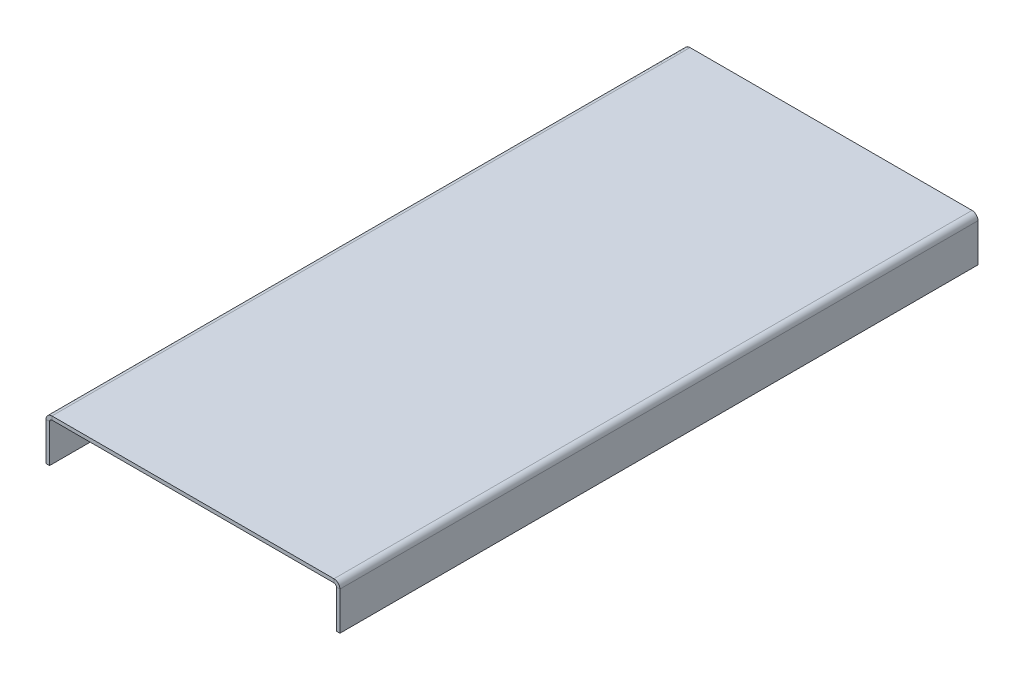
ISO-10303-21;
HEADER;
FILE_DESCRIPTION(('STEP AP214'),'2;1');
FILE_NAME('part.step','',(''),(''),'','','');
FILE_SCHEMA(('AUTOMOTIVE_DESIGN { 1 0 10303 214 1 1 1 1 }'));
ENDSEC;
DATA;
#1=APPLICATION_CONTEXT('core data for automotive mechanical design processes');
#2=APPLICATION_PROTOCOL_DEFINITION('international standard','automotive_design',2000,#1);
#3=PRODUCT_CONTEXT('',#1,'mechanical');
#4=PRODUCT('Part','Part','',(#3));
#5=PRODUCT_RELATED_PRODUCT_CATEGORY('part','',(#4));
#6=PRODUCT_DEFINITION_FORMATION('','',#4);
#7=PRODUCT_DEFINITION_CONTEXT('part definition',#1,'design');
#8=PRODUCT_DEFINITION('design','',#6,#7);
#9=PRODUCT_DEFINITION_SHAPE('','',#8);
#10=(LENGTH_UNIT() NAMED_UNIT(*) SI_UNIT(.MILLI.,.METRE.));
#11=(NAMED_UNIT(*) PLANE_ANGLE_UNIT() SI_UNIT($,.RADIAN.));
#12=(NAMED_UNIT(*) SI_UNIT($,.STERADIAN.) SOLID_ANGLE_UNIT());
#13=UNCERTAINTY_MEASURE_WITH_UNIT(LENGTH_MEASURE(1.E-05),#10,'distance_accuracy_value','');
#14=(GEOMETRIC_REPRESENTATION_CONTEXT(3) GLOBAL_UNCERTAINTY_ASSIGNED_CONTEXT((#13)) GLOBAL_UNIT_ASSIGNED_CONTEXT((#10,
#11,#12)) REPRESENTATION_CONTEXT('',''));
#15=CARTESIAN_POINT('',(0.,0.,0.));
#16=DIRECTION('',(0.,0.,1.));
#17=DIRECTION('',(1.,0.,0.));
#18=AXIS2_PLACEMENT_3D('',#15,#16,#17);
#19=CARTESIAN_POINT('',(120.,118.,0.));
#20=DIRECTION('',(0.,0.,-1.));
#21=DIRECTION('',(-1.,0.,0.));
#22=AXIS2_PLACEMENT_3D('',#19,#20,#21);
#23=PLANE('',#22);
#24=DIRECTION('',(1.,0.,0.));
#25=VECTOR('',#24,1.);
#26=CARTESIAN_POINT('',(120.,118.,0.));
#27=LINE('',#26,#25);
#28=CARTESIAN_POINT('',(120.,118.,0.));
#29=VERTEX_POINT('',#28);
#30=CARTESIAN_POINT('',(123.,118.,0.));
#31=VERTEX_POINT('',#30);
#32=EDGE_CURVE('E11',#29,#31,#27,.T.);
#33=ORIENTED_EDGE('',*,*,#32,.F.);
#34=CARTESIAN_POINT('',(118.,118.,0.));
#35=DIRECTION('',(0.,0.,-1.));
#36=DIRECTION('',(-1.,0.,0.));
#37=AXIS2_PLACEMENT_3D('',#34,#35,#36);
#38=CIRCLE('',#37,2.);
#39=CARTESIAN_POINT('',(118.,120.,0.));
#40=VERTEX_POINT('',#39);
#41=EDGE_CURVE('E192',#29,#40,#38,.F.);
#42=ORIENTED_EDGE('',*,*,#41,.T.);
#43=DIRECTION('',(0.,-1.,0.));
#44=VECTOR('',#43,1.);
#45=CARTESIAN_POINT('',(118.,123.,0.));
#46=LINE('',#45,#44);
#47=CARTESIAN_POINT('',(118.,123.,0.));
#48=VERTEX_POINT('',#47);
#49=EDGE_CURVE('E46',#48,#40,#46,.T.);
#50=ORIENTED_EDGE('',*,*,#49,.F.);
#51=CARTESIAN_POINT('',(118.,118.,0.));
#52=DIRECTION('',(0.,0.,1.));
#53=DIRECTION('',(1.,0.,0.));
#54=AXIS2_PLACEMENT_3D('',#51,#52,#53);
#55=CIRCLE('',#54,5.);
#56=EDGE_CURVE('E213',#31,#48,#55,.T.);
#57=ORIENTED_EDGE('',*,*,#56,.F.);
#58=EDGE_LOOP('',(#33,#42,#50,#57));
#59=FACE_BOUND('',#58,.T.);
#60=ADVANCED_FACE('F39',(#59),#23,.T.);
#61=CARTESIAN_POINT('',(118.,123.,0.));
#62=DIRECTION('',(0.,0.,-1.));
#63=DIRECTION('',(-1.,0.,0.));
#64=AXIS2_PLACEMENT_3D('',#61,#62,#63);
#65=PLANE('',#64);
#66=DIRECTION('',(0.,1.,0.));
#67=VECTOR('',#66,1.);
#68=CARTESIAN_POINT('',(120.,86.,0.));
#69=LINE('',#68,#67);
#70=CARTESIAN_POINT('',(120.,86.,0.));
#71=VERTEX_POINT('',#70);
#72=EDGE_CURVE('E202',#71,#29,#69,.T.);
#73=ORIENTED_EDGE('',*,*,#72,.T.);
#74=ORIENTED_EDGE('',*,*,#32,.T.);
#75=DIRECTION('',(0.,1.,0.));
#76=VECTOR('',#75,1.);
#77=CARTESIAN_POINT('',(123.,86.,0.));
#78=LINE('',#77,#76);
#79=CARTESIAN_POINT('',(123.,86.,0.));
#80=VERTEX_POINT('',#79);
#81=EDGE_CURVE('E210',#80,#31,#78,.T.);
#82=ORIENTED_EDGE('',*,*,#81,.F.);
#83=DIRECTION('',(-1.,0.,0.));
#84=VECTOR('',#83,1.);
#85=CARTESIAN_POINT('',(123.,86.,0.));
#86=LINE('',#85,#84);
#87=EDGE_CURVE('E204',#80,#71,#86,.T.);
#88=ORIENTED_EDGE('',*,*,#87,.T.);
#89=EDGE_LOOP('',(#73,#74,#82,#88));
#90=FACE_BOUND('',#89,.T.);
#91=ADVANCED_FACE('F284',(#90),#65,.T.);
#92=CARTESIAN_POINT('',(-118.,120.,0.));
#93=DIRECTION('',(0.,0.,-1.));
#94=DIRECTION('',(-1.,0.,0.));
#95=AXIS2_PLACEMENT_3D('',#92,#93,#94);
#96=PLANE('',#95);
#97=DIRECTION('',(0.,1.,0.));
#98=VECTOR('',#97,1.);
#99=CARTESIAN_POINT('',(-118.,120.,0.));
#100=LINE('',#99,#98);
#101=CARTESIAN_POINT('',(-118.,120.,0.));
#102=VERTEX_POINT('',#101);
#103=CARTESIAN_POINT('',(-118.,123.,0.));
#104=VERTEX_POINT('',#103);
#105=EDGE_CURVE('E172',#102,#104,#100,.T.);
#106=ORIENTED_EDGE('',*,*,#105,.F.);
#107=CARTESIAN_POINT('',(-118.,118.,0.));
#108=DIRECTION('',(0.,0.,-1.));
#109=DIRECTION('',(-1.,0.,0.));
#110=AXIS2_PLACEMENT_3D('',#107,#108,#109);
#111=CIRCLE('',#110,2.);
#112=CARTESIAN_POINT('',(-120.,118.,0.));
#113=VERTEX_POINT('',#112);
#114=EDGE_CURVE('E199',#102,#113,#111,.F.);
#115=ORIENTED_EDGE('',*,*,#114,.T.);
#116=DIRECTION('',(1.,0.,0.));
#117=VECTOR('',#116,1.);
#118=CARTESIAN_POINT('',(-123.,118.,0.));
#119=LINE('',#118,#117);
#120=CARTESIAN_POINT('',(-123.,118.,0.));
#121=VERTEX_POINT('',#120);
#122=EDGE_CURVE('E61',#121,#113,#119,.T.);
#123=ORIENTED_EDGE('',*,*,#122,.F.);
#124=CARTESIAN_POINT('',(-118.,118.,0.));
#125=DIRECTION('',(0.,0.,1.));
#126=DIRECTION('',(1.,0.,0.));
#127=AXIS2_PLACEMENT_3D('',#124,#125,#126);
#128=CIRCLE('',#127,5.);
#129=EDGE_CURVE('E217',#104,#121,#128,.T.);
#130=ORIENTED_EDGE('',*,*,#129,.F.);
#131=EDGE_LOOP('',(#106,#115,#123,#130));
#132=FACE_BOUND('',#131,.T.);
#133=ADVANCED_FACE('F263',(#132),#96,.T.);
#134=CARTESIAN_POINT('',(-123.,118.,0.));
#135=DIRECTION('',(0.,0.,-1.));
#136=DIRECTION('',(-1.,0.,0.));
#137=AXIS2_PLACEMENT_3D('',#134,#135,#136);
#138=PLANE('',#137);
#139=DIRECTION('',(-1.,0.,0.));
#140=VECTOR('',#139,1.);
#141=CARTESIAN_POINT('',(120.,120.,0.));
#142=LINE('',#141,#140);
#143=EDGE_CURVE('E179',#40,#102,#142,.T.);
#144=ORIENTED_EDGE('',*,*,#143,.T.);
#145=ORIENTED_EDGE('',*,*,#105,.T.);
#146=DIRECTION('',(-1.,0.,0.));
#147=VECTOR('',#146,1.);
#148=CARTESIAN_POINT('',(120.,123.,0.));
#149=LINE('',#148,#147);
#150=EDGE_CURVE('E181',#48,#104,#149,.T.);
#151=ORIENTED_EDGE('',*,*,#150,.F.);
#152=ORIENTED_EDGE('',*,*,#49,.T.);
#153=EDGE_LOOP('',(#144,#145,#151,#152));
#154=FACE_BOUND('',#153,.T.);
#155=ADVANCED_FACE('F177',(#154),#138,.T.);
#156=CARTESIAN_POINT('',(-123.,120.,782.766959220874));
#157=DIRECTION('',(1.,0.,0.));
#158=DIRECTION('',(0.,1.,0.));
#159=AXIS2_PLACEMENT_3D('',#156,#157,#158);
#160=PLANE('',#159);
#161=DIRECTION('',(0.,-1.,0.));
#162=VECTOR('',#161,1.);
#163=CARTESIAN_POINT('',(-123.,120.,534.));
#164=LINE('',#163,#162);
#165=CARTESIAN_POINT('',(-123.,118.,534.));
#166=VERTEX_POINT('',#165);
#167=CARTESIAN_POINT('',(-123.,86.,534.));
#168=VERTEX_POINT('',#167);
#169=EDGE_CURVE('E139',#166,#168,#164,.T.);
#170=ORIENTED_EDGE('',*,*,#169,.F.);
#171=DIRECTION('',(0.,0.,-1.));
#172=VECTOR('',#171,1.);
#173=CARTESIAN_POINT('',(-123.,118.,782.766959220874));
#174=LINE('',#173,#172);
#175=EDGE_CURVE('E220',#166,#121,#174,.T.);
#176=ORIENTED_EDGE('',*,*,#175,.T.);
#177=DIRECTION('',(0.,-1.,0.));
#178=VECTOR('',#177,1.);
#179=CARTESIAN_POINT('',(-123.,120.,0.));
#180=LINE('',#179,#178);
#181=CARTESIAN_POINT('',(-123.,86.,0.));
#182=VERTEX_POINT('',#181);
#183=EDGE_CURVE('E256',#121,#182,#180,.T.);
#184=ORIENTED_EDGE('',*,*,#183,.T.);
#185=DIRECTION('',(0.,0.,-1.));
#186=VECTOR('',#185,1.);
#187=CARTESIAN_POINT('',(-123.,86.,782.766959220874));
#188=LINE('',#187,#186);
#189=EDGE_CURVE('E164',#168,#182,#188,.T.);
#190=ORIENTED_EDGE('',*,*,#189,.F.);
#191=EDGE_LOOP('',(#170,#176,#184,#190));
#192=FACE_BOUND('',#191,.T.);
#193=ADVANCED_FACE('F318',(#192),#160,.F.);
#194=CARTESIAN_POINT('',(-120.,86.,782.766959220874));
#195=DIRECTION('',(0.,-1.,0.));
#196=DIRECTION('',(0.,0.,-1.));
#197=AXIS2_PLACEMENT_3D('',#194,#195,#196);
#198=PLANE('',#197);
#199=DIRECTION('',(0.,0.,-1.));
#200=VECTOR('',#199,1.);
#201=CARTESIAN_POINT('',(-120.,86.,782.766959220874));
#202=LINE('',#201,#200);
#203=CARTESIAN_POINT('',(-120.,86.,534.));
#204=VERTEX_POINT('',#203);
#205=CARTESIAN_POINT('',(-120.,86.,0.));
#206=VERTEX_POINT('',#205);
#207=EDGE_CURVE('E162',#204,#206,#202,.T.);
#208=ORIENTED_EDGE('',*,*,#207,.F.);
#209=DIRECTION('',(-1.,0.,0.));
#210=VECTOR('',#209,1.);
#211=CARTESIAN_POINT('',(-123.,86.,534.));
#212=LINE('',#211,#210);
#213=EDGE_CURVE('E135',#168,#204,#212,.F.);
#214=ORIENTED_EDGE('',*,*,#213,.F.);
#215=ORIENTED_EDGE('',*,*,#189,.T.);
#216=DIRECTION('',(-1.,0.,0.));
#217=VECTOR('',#216,1.);
#218=CARTESIAN_POINT('',(-120.,86.,0.));
#219=LINE('',#218,#217);
#220=EDGE_CURVE('E260',#206,#182,#219,.T.);
#221=ORIENTED_EDGE('',*,*,#220,.F.);
#222=EDGE_LOOP('',(#208,#214,#215,#221));
#223=FACE_BOUND('',#222,.T.);
#224=ADVANCED_FACE('F321',(#223),#198,.T.);
#225=CARTESIAN_POINT('',(-120.,120.,782.766959220874));
#226=DIRECTION('',(1.,0.,0.));
#227=DIRECTION('',(0.,1.,0.));
#228=AXIS2_PLACEMENT_3D('',#225,#226,#227);
#229=PLANE('',#228);
#230=DIRECTION('',(0.,0.,-1.));
#231=VECTOR('',#230,1.);
#232=CARTESIAN_POINT('',(-120.,118.,782.766959220874));
#233=LINE('',#232,#231);
#234=CARTESIAN_POINT('',(-120.,118.,534.));
#235=VERTEX_POINT('',#234);
#236=EDGE_CURVE('E153',#235,#113,#233,.T.);
#237=ORIENTED_EDGE('',*,*,#236,.F.);
#238=DIRECTION('',(0.,1.,0.));
#239=VECTOR('',#238,1.);
#240=CARTESIAN_POINT('',(-120.,120.,534.));
#241=LINE('',#240,#239);
#242=EDGE_CURVE('E129',#235,#204,#241,.F.);
#243=ORIENTED_EDGE('',*,*,#242,.T.);
#244=ORIENTED_EDGE('',*,*,#207,.T.);
#245=DIRECTION('',(0.,-1.,0.));
#246=VECTOR('',#245,1.);
#247=CARTESIAN_POINT('',(-120.,120.,0.));
#248=LINE('',#247,#246);
#249=EDGE_CURVE('E161',#113,#206,#248,.T.);
#250=ORIENTED_EDGE('',*,*,#249,.F.);
#251=EDGE_LOOP('',(#237,#243,#244,#250));
#252=FACE_BOUND('',#251,.T.);
#253=ADVANCED_FACE('F159',(#252),#229,.T.);
#254=CARTESIAN_POINT('',(-118.,118.,782.766959220874));
#255=DIRECTION('',(0.,0.,-1.));
#256=DIRECTION('',(-1.,0.,0.));
#257=AXIS2_PLACEMENT_3D('',#254,#255,#256);
#258=CYLINDRICAL_SURFACE('',#257,2.);
#259=DIRECTION('',(0.,0.,-1.));
#260=VECTOR('',#259,1.);
#261=CARTESIAN_POINT('',(-118.,120.,782.766959220874));
#262=LINE('',#261,#260);
#263=CARTESIAN_POINT('',(-118.,120.,534.));
#264=VERTEX_POINT('',#263);
#265=EDGE_CURVE('E156',#264,#102,#262,.T.);
#266=ORIENTED_EDGE('',*,*,#265,.F.);
#267=CARTESIAN_POINT('',(-118.,118.,534.));
#268=DIRECTION('',(0.,0.,-1.));
#269=DIRECTION('',(-1.,0.,0.));
#270=AXIS2_PLACEMENT_3D('',#267,#268,#269);
#271=CIRCLE('',#270,2.);
#272=EDGE_CURVE('E144',#235,#264,#271,.T.);
#273=ORIENTED_EDGE('',*,*,#272,.F.);
#274=ORIENTED_EDGE('',*,*,#236,.T.);
#275=ORIENTED_EDGE('',*,*,#114,.F.);
#276=EDGE_LOOP('',(#266,#273,#274,#275));
#277=FACE_BOUND('',#276,.T.);
#278=ADVANCED_FACE('F151',(#277),#258,.F.);
#279=CARTESIAN_POINT('',(120.,120.,782.766959220874));
#280=DIRECTION('',(0.,-1.,0.));
#281=DIRECTION('',(1.,0.,0.));
#282=AXIS2_PLACEMENT_3D('',#279,#280,#281);
#283=PLANE('',#282);
#284=DIRECTION('',(0.,0.,-1.));
#285=VECTOR('',#284,1.);
#286=CARTESIAN_POINT('',(118.,120.,782.766959220874));
#287=LINE('',#286,#285);
#288=CARTESIAN_POINT('',(118.,120.,534.));
#289=VERTEX_POINT('',#288);
#290=EDGE_CURVE('E166',#289,#40,#287,.T.);
#291=ORIENTED_EDGE('',*,*,#290,.F.);
#292=DIRECTION('',(1.,0.,0.));
#293=VECTOR('',#292,1.);
#294=CARTESIAN_POINT('',(120.,120.,534.));
#295=LINE('',#294,#293);
#296=EDGE_CURVE('E295',#289,#264,#295,.F.);
#297=ORIENTED_EDGE('',*,*,#296,.T.);
#298=ORIENTED_EDGE('',*,*,#265,.T.);
#299=ORIENTED_EDGE('',*,*,#143,.F.);
#300=EDGE_LOOP('',(#291,#297,#298,#299));
#301=FACE_BOUND('',#300,.T.);
#302=ADVANCED_FACE('F198',(#301),#283,.T.);
#303=CARTESIAN_POINT('',(118.,118.,782.766959220874));
#304=DIRECTION('',(0.,0.,-1.));
#305=DIRECTION('',(-1.,0.,0.));
#306=AXIS2_PLACEMENT_3D('',#303,#304,#305);
#307=CYLINDRICAL_SURFACE('',#306,2.);
#308=DIRECTION('',(0.,0.,-1.));
#309=VECTOR('',#308,1.);
#310=CARTESIAN_POINT('',(120.,118.,782.766959220874));
#311=LINE('',#310,#309);
#312=CARTESIAN_POINT('',(120.,118.,534.));
#313=VERTEX_POINT('',#312);
#314=EDGE_CURVE('E197',#313,#29,#311,.T.);
#315=ORIENTED_EDGE('',*,*,#314,.F.);
#316=CARTESIAN_POINT('',(118.,118.,534.));
#317=DIRECTION('',(0.,0.,-1.));
#318=DIRECTION('',(-1.,0.,0.));
#319=AXIS2_PLACEMENT_3D('',#316,#317,#318);
#320=CIRCLE('',#319,2.);
#321=EDGE_CURVE('E194',#289,#313,#320,.T.);
#322=ORIENTED_EDGE('',*,*,#321,.F.);
#323=ORIENTED_EDGE('',*,*,#290,.T.);
#324=ORIENTED_EDGE('',*,*,#41,.F.);
#325=EDGE_LOOP('',(#315,#322,#323,#324));
#326=FACE_BOUND('',#325,.T.);
#327=ADVANCED_FACE('F191',(#326),#307,.F.);
#328=CARTESIAN_POINT('',(120.,86.,782.766959220874));
#329=DIRECTION('',(-1.,0.,0.));
#330=DIRECTION('',(0.,0.,1.));
#331=AXIS2_PLACEMENT_3D('',#328,#329,#330);
#332=PLANE('',#331);
#333=DIRECTION('',(0.,0.,-1.));
#334=VECTOR('',#333,1.);
#335=CARTESIAN_POINT('',(120.,86.,782.766959220874));
#336=LINE('',#335,#334);
#337=CARTESIAN_POINT('',(120.,86.,534.));
#338=VERTEX_POINT('',#337);
#339=EDGE_CURVE('E232',#338,#71,#336,.T.);
#340=ORIENTED_EDGE('',*,*,#339,.F.);
#341=DIRECTION('',(0.,1.,0.));
#342=VECTOR('',#341,1.);
#343=CARTESIAN_POINT('',(120.,86.,534.));
#344=LINE('',#343,#342);
#345=EDGE_CURVE('E239',#338,#313,#344,.T.);
#346=ORIENTED_EDGE('',*,*,#345,.T.);
#347=ORIENTED_EDGE('',*,*,#314,.T.);
#348=ORIENTED_EDGE('',*,*,#72,.F.);
#349=EDGE_LOOP('',(#340,#346,#347,#348));
#350=FACE_BOUND('',#349,.T.);
#351=ADVANCED_FACE('F238',(#350),#332,.T.);
#352=CARTESIAN_POINT('',(123.,86.,782.766959220874));
#353=DIRECTION('',(0.,-1.,0.));
#354=DIRECTION('',(0.,0.,-1.));
#355=AXIS2_PLACEMENT_3D('',#352,#353,#354);
#356=PLANE('',#355);
#357=DIRECTION('',(0.,0.,-1.));
#358=VECTOR('',#357,1.);
#359=CARTESIAN_POINT('',(123.,86.,782.766959220874));
#360=LINE('',#359,#358);
#361=CARTESIAN_POINT('',(123.,86.,534.));
#362=VERTEX_POINT('',#361);
#363=EDGE_CURVE('E230',#362,#80,#360,.T.);
#364=ORIENTED_EDGE('',*,*,#363,.F.);
#365=DIRECTION('',(1.,0.,0.));
#366=VECTOR('',#365,1.);
#367=CARTESIAN_POINT('',(123.,86.,534.));
#368=LINE('',#367,#366);
#369=EDGE_CURVE('E243',#362,#338,#368,.F.);
#370=ORIENTED_EDGE('',*,*,#369,.T.);
#371=ORIENTED_EDGE('',*,*,#339,.T.);
#372=ORIENTED_EDGE('',*,*,#87,.F.);
#373=EDGE_LOOP('',(#364,#370,#371,#372));
#374=FACE_BOUND('',#373,.T.);
#375=ADVANCED_FACE('F286',(#374),#356,.T.);
#376=CARTESIAN_POINT('',(123.,86.,782.766959220874));
#377=DIRECTION('',(-1.,0.,0.));
#378=DIRECTION('',(0.,0.,1.));
#379=AXIS2_PLACEMENT_3D('',#376,#377,#378);
#380=PLANE('',#379);
#381=DIRECTION('',(0.,1.,0.));
#382=VECTOR('',#381,1.);
#383=CARTESIAN_POINT('',(123.,86.,534.));
#384=LINE('',#383,#382);
#385=CARTESIAN_POINT('',(123.,118.,534.));
#386=VERTEX_POINT('',#385);
#387=EDGE_CURVE('E157',#362,#386,#384,.T.);
#388=ORIENTED_EDGE('',*,*,#387,.F.);
#389=ORIENTED_EDGE('',*,*,#363,.T.);
#390=ORIENTED_EDGE('',*,*,#81,.T.);
#391=DIRECTION('',(0.,0.,-1.));
#392=VECTOR('',#391,1.);
#393=CARTESIAN_POINT('',(123.,118.,782.766959220874));
#394=LINE('',#393,#392);
#395=EDGE_CURVE('E227',#386,#31,#394,.T.);
#396=ORIENTED_EDGE('',*,*,#395,.F.);
#397=EDGE_LOOP('',(#388,#389,#390,#396));
#398=FACE_BOUND('',#397,.T.);
#399=ADVANCED_FACE('F280',(#398),#380,.F.);
#400=CARTESIAN_POINT('',(118.,118.,782.766959220874));
#401=DIRECTION('',(0.,0.,-1.));
#402=DIRECTION('',(-1.,0.,0.));
#403=AXIS2_PLACEMENT_3D('',#400,#401,#402);
#404=CYLINDRICAL_SURFACE('',#403,5.);
#405=CARTESIAN_POINT('',(118.,118.,534.));
#406=DIRECTION('',(0.,0.,1.));
#407=DIRECTION('',(1.,0.,0.));
#408=AXIS2_PLACEMENT_3D('',#405,#406,#407);
#409=CIRCLE('',#408,5.);
#410=CARTESIAN_POINT('',(118.,123.,534.));
#411=VERTEX_POINT('',#410);
#412=EDGE_CURVE('E276',#386,#411,#409,.T.);
#413=ORIENTED_EDGE('',*,*,#412,.F.);
#414=ORIENTED_EDGE('',*,*,#395,.T.);
#415=ORIENTED_EDGE('',*,*,#56,.T.);
#416=DIRECTION('',(0.,0.,-1.));
#417=VECTOR('',#416,1.);
#418=CARTESIAN_POINT('',(118.,123.,782.766959220874));
#419=LINE('',#418,#417);
#420=EDGE_CURVE('E225',#411,#48,#419,.T.);
#421=ORIENTED_EDGE('',*,*,#420,.F.);
#422=EDGE_LOOP('',(#413,#414,#415,#421));
#423=FACE_BOUND('',#422,.T.);
#424=ADVANCED_FACE('F274',(#423),#404,.T.);
#425=CARTESIAN_POINT('',(120.,123.,782.766959220874));
#426=DIRECTION('',(0.,-1.,0.));
#427=DIRECTION('',(1.,0.,0.));
#428=AXIS2_PLACEMENT_3D('',#425,#426,#427);
#429=PLANE('',#428);
#430=DIRECTION('',(-1.,0.,0.));
#431=VECTOR('',#430,1.);
#432=CARTESIAN_POINT('',(120.,123.,534.));
#433=LINE('',#432,#431);
#434=CARTESIAN_POINT('',(-118.,123.,534.));
#435=VERTEX_POINT('',#434);
#436=EDGE_CURVE('E53',#411,#435,#433,.T.);
#437=ORIENTED_EDGE('',*,*,#436,.F.);
#438=ORIENTED_EDGE('',*,*,#420,.T.);
#439=ORIENTED_EDGE('',*,*,#150,.T.);
#440=DIRECTION('',(0.,0.,-1.));
#441=VECTOR('',#440,1.);
#442=CARTESIAN_POINT('',(-118.,123.,782.766959220874));
#443=LINE('',#442,#441);
#444=EDGE_CURVE('E222',#435,#104,#443,.T.);
#445=ORIENTED_EDGE('',*,*,#444,.F.);
#446=EDGE_LOOP('',(#437,#438,#439,#445));
#447=FACE_BOUND('',#446,.T.);
#448=ADVANCED_FACE('F270',(#447),#429,.F.);
#449=CARTESIAN_POINT('',(-118.,118.,782.766959220874));
#450=DIRECTION('',(0.,0.,-1.));
#451=DIRECTION('',(-1.,0.,0.));
#452=AXIS2_PLACEMENT_3D('',#449,#450,#451);
#453=CYLINDRICAL_SURFACE('',#452,5.);
#454=CARTESIAN_POINT('',(-118.,118.,534.));
#455=DIRECTION('',(0.,0.,1.));
#456=DIRECTION('',(1.,0.,0.));
#457=AXIS2_PLACEMENT_3D('',#454,#455,#456);
#458=CIRCLE('',#457,5.);
#459=EDGE_CURVE('E146',#435,#166,#458,.T.);
#460=ORIENTED_EDGE('',*,*,#459,.F.);
#461=ORIENTED_EDGE('',*,*,#444,.T.);
#462=ORIENTED_EDGE('',*,*,#129,.T.);
#463=ORIENTED_EDGE('',*,*,#175,.F.);
#464=EDGE_LOOP('',(#460,#461,#462,#463));
#465=FACE_BOUND('',#464,.T.);
#466=ADVANCED_FACE('F266',(#465),#453,.T.);
#467=CARTESIAN_POINT('',(-118.,118.,0.));
#468=DIRECTION('',(0.,0.,-1.));
#469=DIRECTION('',(-1.,0.,0.));
#470=AXIS2_PLACEMENT_3D('',#467,#468,#469);
#471=PLANE('',#470);
#472=ORIENTED_EDGE('',*,*,#183,.F.);
#473=ORIENTED_EDGE('',*,*,#122,.T.);
#474=ORIENTED_EDGE('',*,*,#249,.T.);
#475=ORIENTED_EDGE('',*,*,#220,.T.);
#476=EDGE_LOOP('',(#472,#473,#474,#475));
#477=FACE_BOUND('',#476,.T.);
#478=ADVANCED_FACE('F346',(#477),#471,.T.);
#479=CARTESIAN_POINT('',(-123.,120.,534.));
#480=DIRECTION('',(0.,0.,1.));
#481=DIRECTION('',(0.,-1.,0.));
#482=AXIS2_PLACEMENT_3D('',#479,#480,#481);
#483=PLANE('',#482);
#484=ORIENTED_EDGE('',*,*,#169,.T.);
#485=ORIENTED_EDGE('',*,*,#213,.T.);
#486=ORIENTED_EDGE('',*,*,#242,.F.);
#487=DIRECTION('',(-1.,0.,0.));
#488=VECTOR('',#487,1.);
#489=CARTESIAN_POINT('',(-123.,118.,534.));
#490=LINE('',#489,#488);
#491=EDGE_CURVE('E132',#166,#235,#490,.F.);
#492=ORIENTED_EDGE('',*,*,#491,.F.);
#493=EDGE_LOOP('',(#484,#485,#486,#492));
#494=FACE_BOUND('',#493,.T.);
#495=ADVANCED_FACE('F131',(#494),#483,.T.);
#496=CARTESIAN_POINT('',(123.,86.,534.));
#497=DIRECTION('',(0.,0.,1.));
#498=DIRECTION('',(0.,1.,0.));
#499=AXIS2_PLACEMENT_3D('',#496,#497,#498);
#500=PLANE('',#499);
#501=ORIENTED_EDGE('',*,*,#387,.T.);
#502=DIRECTION('',(1.,0.,0.));
#503=VECTOR('',#502,1.);
#504=CARTESIAN_POINT('',(123.,118.,534.));
#505=LINE('',#504,#503);
#506=EDGE_CURVE('E245',#386,#313,#505,.F.);
#507=ORIENTED_EDGE('',*,*,#506,.T.);
#508=ORIENTED_EDGE('',*,*,#345,.F.);
#509=ORIENTED_EDGE('',*,*,#369,.F.);
#510=EDGE_LOOP('',(#501,#507,#508,#509));
#511=FACE_BOUND('',#510,.T.);
#512=ADVANCED_FACE('F287',(#511),#500,.T.);
#513=CARTESIAN_POINT('',(118.,118.,534.));
#514=DIRECTION('',(0.,0.,-1.));
#515=DIRECTION('',(-1.,0.,0.));
#516=AXIS2_PLACEMENT_3D('',#513,#514,#515);
#517=PLANE('',#516);
#518=ORIENTED_EDGE('',*,*,#321,.T.);
#519=ORIENTED_EDGE('',*,*,#506,.F.);
#520=ORIENTED_EDGE('',*,*,#412,.T.);
#521=DIRECTION('',(0.,1.,0.));
#522=VECTOR('',#521,1.);
#523=CARTESIAN_POINT('',(118.,123.,534.));
#524=LINE('',#523,#522);
#525=EDGE_CURVE('E250',#411,#289,#524,.F.);
#526=ORIENTED_EDGE('',*,*,#525,.T.);
#527=EDGE_LOOP('',(#518,#519,#520,#526));
#528=FACE_BOUND('',#527,.T.);
#529=ADVANCED_FACE('F289',(#528),#517,.F.);
#530=CARTESIAN_POINT('',(120.,123.,534.));
#531=DIRECTION('',(0.,0.,1.));
#532=DIRECTION('',(-1.,0.,0.));
#533=AXIS2_PLACEMENT_3D('',#530,#531,#532);
#534=PLANE('',#533);
#535=ORIENTED_EDGE('',*,*,#436,.T.);
#536=DIRECTION('',(0.,1.,0.));
#537=VECTOR('',#536,1.);
#538=CARTESIAN_POINT('',(-118.,123.,534.));
#539=LINE('',#538,#537);
#540=EDGE_CURVE('E255',#435,#264,#539,.F.);
#541=ORIENTED_EDGE('',*,*,#540,.T.);
#542=ORIENTED_EDGE('',*,*,#296,.F.);
#543=ORIENTED_EDGE('',*,*,#525,.F.);
#544=EDGE_LOOP('',(#535,#541,#542,#543));
#545=FACE_BOUND('',#544,.T.);
#546=ADVANCED_FACE('F297',(#545),#534,.T.);
#547=CARTESIAN_POINT('',(-118.,118.,534.));
#548=DIRECTION('',(0.,0.,-1.));
#549=DIRECTION('',(-1.,0.,0.));
#550=AXIS2_PLACEMENT_3D('',#547,#548,#549);
#551=PLANE('',#550);
#552=ORIENTED_EDGE('',*,*,#272,.T.);
#553=ORIENTED_EDGE('',*,*,#540,.F.);
#554=ORIENTED_EDGE('',*,*,#459,.T.);
#555=ORIENTED_EDGE('',*,*,#491,.T.);
#556=EDGE_LOOP('',(#552,#553,#554,#555));
#557=FACE_BOUND('',#556,.T.);
#558=ADVANCED_FACE('F143',(#557),#551,.F.);
#559=CLOSED_SHELL('',(#60,#91,#133,#155,#193,#224,#253,#278,#302,#327,#351,#375,#399,#424,#448,
#466,#478,#495,#512,#529,#546,#558));
#560=MANIFOLD_SOLID_BREP('B2',#559);
#561=ADVANCED_BREP_SHAPE_REPRESENTATION('',(#18,#560),#14);
#562=SHAPE_DEFINITION_REPRESENTATION(#9,#561);
ENDSEC;
END-ISO-10303-21;
